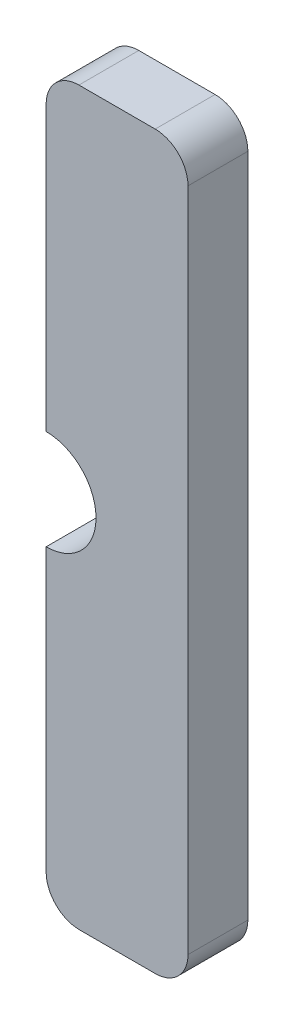
ISO-10303-21;
HEADER;
FILE_DESCRIPTION(('STEP AP214'),'2;1');
FILE_NAME('part.step','',(''),(''),'','','');
FILE_SCHEMA(('AUTOMOTIVE_DESIGN { 1 0 10303 214 1 1 1 1 }'));
ENDSEC;
DATA;
#1=APPLICATION_CONTEXT('core data for automotive mechanical design processes');
#2=APPLICATION_PROTOCOL_DEFINITION('international standard','automotive_design',2000,#1);
#3=PRODUCT_CONTEXT('',#1,'mechanical');
#4=PRODUCT('Part','Part','',(#3));
#5=PRODUCT_RELATED_PRODUCT_CATEGORY('part','',(#4));
#6=PRODUCT_DEFINITION_FORMATION('','',#4);
#7=PRODUCT_DEFINITION_CONTEXT('part definition',#1,'design');
#8=PRODUCT_DEFINITION('design','',#6,#7);
#9=PRODUCT_DEFINITION_SHAPE('','',#8);
#10=(LENGTH_UNIT() NAMED_UNIT(*) SI_UNIT(.MILLI.,.METRE.));
#11=(NAMED_UNIT(*) PLANE_ANGLE_UNIT() SI_UNIT($,.RADIAN.));
#12=(NAMED_UNIT(*) SI_UNIT($,.STERADIAN.) SOLID_ANGLE_UNIT());
#13=UNCERTAINTY_MEASURE_WITH_UNIT(LENGTH_MEASURE(1.E-05),#10,'distance_accuracy_value','');
#14=(GEOMETRIC_REPRESENTATION_CONTEXT(3) GLOBAL_UNCERTAINTY_ASSIGNED_CONTEXT((#13)) GLOBAL_UNIT_ASSIGNED_CONTEXT((#10,
#11,#12)) REPRESENTATION_CONTEXT('',''));
#15=CARTESIAN_POINT('',(0.,0.,0.));
#16=DIRECTION('',(0.,0.,1.));
#17=DIRECTION('',(1.,0.,0.));
#18=AXIS2_PLACEMENT_3D('',#15,#16,#17);
#19=CARTESIAN_POINT('',(32.3994125239925,26.550586330623,2.1));
#20=DIRECTION('',(0.,0.,-1.));
#21=DIRECTION('',(-1.,0.,0.));
#22=AXIS2_PLACEMENT_3D('',#19,#20,#21);
#23=CYLINDRICAL_SURFACE('',#22,1.15058686285202);
#24=CARTESIAN_POINT('',(32.3994125239925,26.550586330623,0.));
#25=DIRECTION('',(0.,0.,-1.));
#26=DIRECTION('',(-1.,0.,0.));
#27=AXIS2_PLACEMENT_3D('',#24,#25,#26);
#28=CIRCLE('',#27,1.15058686285202);
#29=CARTESIAN_POINT('',(33.5499992370605,26.5499992370606,0.));
#30=VERTEX_POINT('',#29);
#31=CARTESIAN_POINT('',(32.4000015258789,25.3999996185303,0.));
#32=VERTEX_POINT('',#31);
#33=EDGE_CURVE('E144',#30,#32,#28,.T.);
#34=ORIENTED_EDGE('',*,*,#33,.F.);
#35=DIRECTION('',(0.,0.,-1.));
#36=VECTOR('',#35,1.);
#37=CARTESIAN_POINT('',(33.5499992370605,26.5499992370606,2.1));
#38=LINE('',#37,#36);
#39=CARTESIAN_POINT('',(33.5499992370605,26.5499992370606,2.1));
#40=VERTEX_POINT('',#39);
#41=EDGE_CURVE('E11',#40,#30,#38,.T.);
#42=ORIENTED_EDGE('',*,*,#41,.F.);
#43=CARTESIAN_POINT('',(32.3994125239925,26.550586330623,2.1));
#44=DIRECTION('',(0.,0.,-1.));
#45=DIRECTION('',(-1.,0.,0.));
#46=AXIS2_PLACEMENT_3D('',#43,#44,#45);
#47=CIRCLE('',#46,1.15058686285202);
#48=CARTESIAN_POINT('',(32.4000015258789,25.3999996185303,2.1));
#49=VERTEX_POINT('',#48);
#50=EDGE_CURVE('E170',#40,#49,#47,.T.);
#51=ORIENTED_EDGE('',*,*,#50,.T.);
#52=DIRECTION('',(0.,0.,-1.));
#53=VECTOR('',#52,1.);
#54=CARTESIAN_POINT('',(32.4000015258789,25.3999996185303,2.1));
#55=LINE('',#54,#53);
#56=EDGE_CURVE('E38',#49,#32,#55,.T.);
#57=ORIENTED_EDGE('',*,*,#56,.T.);
#58=EDGE_LOOP('',(#34,#42,#51,#57));
#59=FACE_BOUND('',#58,.T.);
#60=ADVANCED_FACE('F35',(#59),#23,.T.);
#61=CARTESIAN_POINT('',(33.5499992370605,49.9000015258789,2.1));
#62=DIRECTION('',(1.,0.,0.));
#63=DIRECTION('',(0.,0.,-1.));
#64=AXIS2_PLACEMENT_3D('',#61,#62,#63);
#65=PLANE('',#64);
#66=DIRECTION('',(0.,-1.,0.));
#67=VECTOR('',#66,1.);
#68=CARTESIAN_POINT('',(33.5499992370605,49.9000015258789,0.));
#69=LINE('',#68,#67);
#70=CARTESIAN_POINT('',(33.5499992370605,49.9000015258789,0.));
#71=VERTEX_POINT('',#70);
#72=EDGE_CURVE('E168',#71,#30,#69,.T.);
#73=ORIENTED_EDGE('',*,*,#72,.F.);
#74=DIRECTION('',(0.,0.,-1.));
#75=VECTOR('',#74,1.);
#76=CARTESIAN_POINT('',(33.5499992370605,49.9000015258789,2.1));
#77=LINE('',#76,#75);
#78=CARTESIAN_POINT('',(33.5499992370605,49.9000015258789,2.1));
#79=VERTEX_POINT('',#78);
#80=EDGE_CURVE('E44',#79,#71,#77,.T.);
#81=ORIENTED_EDGE('',*,*,#80,.F.);
#82=DIRECTION('',(0.,-1.,0.));
#83=VECTOR('',#82,1.);
#84=CARTESIAN_POINT('',(33.5499992370605,49.9000015258789,2.1));
#85=LINE('',#84,#83);
#86=EDGE_CURVE('E134',#79,#40,#85,.T.);
#87=ORIENTED_EDGE('',*,*,#86,.T.);
#88=ORIENTED_EDGE('',*,*,#41,.T.);
#89=EDGE_LOOP('',(#73,#81,#87,#88));
#90=FACE_BOUND('',#89,.T.);
#91=ADVANCED_FACE('F186',(#90),#65,.T.);
#92=CARTESIAN_POINT('',(32.3994157833647,49.8994157833647,2.1));
#93=DIRECTION('',(0.,0.,-1.));
#94=DIRECTION('',(-1.,0.,0.));
#95=AXIS2_PLACEMENT_3D('',#92,#93,#94);
#96=CYLINDRICAL_SURFACE('',#95,1.15058360279163);
#97=CARTESIAN_POINT('',(32.3994157833647,49.8994157833647,0.));
#98=DIRECTION('',(0.,0.,-1.));
#99=DIRECTION('',(-1.,0.,0.));
#100=AXIS2_PLACEMENT_3D('',#97,#98,#99);
#101=CIRCLE('',#100,1.15058360279163);
#102=CARTESIAN_POINT('',(32.4000015258789,51.0499992370605,0.));
#103=VERTEX_POINT('',#102);
#104=EDGE_CURVE('E121',#103,#71,#101,.T.);
#105=ORIENTED_EDGE('',*,*,#104,.F.);
#106=DIRECTION('',(0.,0.,-1.));
#107=VECTOR('',#106,1.);
#108=CARTESIAN_POINT('',(32.4000015258789,51.0499992370605,2.1));
#109=LINE('',#108,#107);
#110=CARTESIAN_POINT('',(32.4000015258789,51.0499992370605,2.1));
#111=VERTEX_POINT('',#110);
#112=EDGE_CURVE('E116',#111,#103,#109,.T.);
#113=ORIENTED_EDGE('',*,*,#112,.F.);
#114=CARTESIAN_POINT('',(32.3994157833647,49.8994157833647,2.1));
#115=DIRECTION('',(0.,0.,-1.));
#116=DIRECTION('',(-1.,0.,0.));
#117=AXIS2_PLACEMENT_3D('',#114,#115,#116);
#118=CIRCLE('',#117,1.15058360279163);
#119=EDGE_CURVE('E119',#111,#79,#118,.T.);
#120=ORIENTED_EDGE('',*,*,#119,.T.);
#121=ORIENTED_EDGE('',*,*,#80,.T.);
#122=EDGE_LOOP('',(#105,#113,#120,#121));
#123=FACE_BOUND('',#122,.T.);
#124=ADVANCED_FACE('F118',(#123),#96,.T.);
#125=CARTESIAN_POINT('',(29.7250003814697,51.0499992370605,2.1));
#126=DIRECTION('',(0.,1.,0.));
#127=DIRECTION('',(0.,0.,1.));
#128=AXIS2_PLACEMENT_3D('',#125,#126,#127);
#129=PLANE('',#128);
#130=DIRECTION('',(1.,0.,0.));
#131=VECTOR('',#130,1.);
#132=CARTESIAN_POINT('',(29.7250003814697,51.0499992370605,0.));
#133=LINE('',#132,#131);
#134=CARTESIAN_POINT('',(29.7250003814697,51.0499992370605,0.));
#135=VERTEX_POINT('',#134);
#136=EDGE_CURVE('E165',#135,#103,#133,.T.);
#137=ORIENTED_EDGE('',*,*,#136,.F.);
#138=DIRECTION('',(0.,0.,-1.));
#139=VECTOR('',#138,1.);
#140=CARTESIAN_POINT('',(29.7250003814697,51.0499992370605,2.1));
#141=LINE('',#140,#139);
#142=CARTESIAN_POINT('',(29.7250003814697,51.0499992370605,2.1));
#143=VERTEX_POINT('',#142);
#144=EDGE_CURVE('E126',#143,#135,#141,.T.);
#145=ORIENTED_EDGE('',*,*,#144,.F.);
#146=DIRECTION('',(1.,0.,0.));
#147=VECTOR('',#146,1.);
#148=CARTESIAN_POINT('',(29.7250003814697,51.0499992370605,2.1));
#149=LINE('',#148,#147);
#150=EDGE_CURVE('E132',#143,#111,#149,.T.);
#151=ORIENTED_EDGE('',*,*,#150,.T.);
#152=ORIENTED_EDGE('',*,*,#112,.T.);
#153=EDGE_LOOP('',(#137,#145,#151,#152));
#154=FACE_BOUND('',#153,.T.);
#155=ADVANCED_FACE('F136',(#154),#129,.T.);
#156=CARTESIAN_POINT('',(29.7255874750322,49.8994125239925,2.1));
#157=DIRECTION('',(0.,0.,-1.));
#158=DIRECTION('',(-1.,0.,0.));
#159=AXIS2_PLACEMENT_3D('',#156,#157,#158);
#160=CYLINDRICAL_SURFACE('',#159,1.15058686285202);
#161=CARTESIAN_POINT('',(29.7255874750322,49.8994125239925,0.));
#162=DIRECTION('',(0.,0.,-1.));
#163=DIRECTION('',(-1.,0.,0.));
#164=AXIS2_PLACEMENT_3D('',#161,#162,#163);
#165=CIRCLE('',#164,1.15058686285202);
#166=CARTESIAN_POINT('',(28.5750358508394,49.9084174690227,0.));
#167=VERTEX_POINT('',#166);
#168=EDGE_CURVE('E162',#167,#135,#165,.T.);
#169=ORIENTED_EDGE('',*,*,#168,.F.);
#170=DIRECTION('',(0.,0.,-1.));
#171=VECTOR('',#170,1.);
#172=CARTESIAN_POINT('',(28.5750358508394,49.9084174690227,2.1));
#173=LINE('',#172,#171);
#174=CARTESIAN_POINT('',(28.5750358508394,49.9084174690227,2.1));
#175=VERTEX_POINT('',#174);
#176=EDGE_CURVE('E174',#175,#167,#173,.T.);
#177=ORIENTED_EDGE('',*,*,#176,.F.);
#178=CARTESIAN_POINT('',(29.7255874750322,49.8994125239925,2.1));
#179=DIRECTION('',(0.,0.,-1.));
#180=DIRECTION('',(-1.,0.,0.));
#181=AXIS2_PLACEMENT_3D('',#178,#179,#180);
#182=CIRCLE('',#181,1.15058686285202);
#183=EDGE_CURVE('E137',#175,#143,#182,.T.);
#184=ORIENTED_EDGE('',*,*,#183,.T.);
#185=ORIENTED_EDGE('',*,*,#144,.T.);
#186=EDGE_LOOP('',(#169,#177,#184,#185));
#187=FACE_BOUND('',#186,.T.);
#188=ADVANCED_FACE('F199',(#187),#160,.T.);
#189=CARTESIAN_POINT('',(28.5750358508394,39.9501794441424,2.1));
#190=DIRECTION('',(-1.,0.,0.));
#191=DIRECTION('',(0.,-1.,0.));
#192=AXIS2_PLACEMENT_3D('',#189,#190,#191);
#193=PLANE('',#192);
#194=DIRECTION('',(0.,1.,0.));
#195=VECTOR('',#194,1.);
#196=CARTESIAN_POINT('',(28.5750358508394,39.9501794441424,0.));
#197=LINE('',#196,#195);
#198=CARTESIAN_POINT('',(28.5750358508394,39.9501794441424,0.));
#199=VERTEX_POINT('',#198);
#200=EDGE_CURVE('E159',#199,#167,#197,.T.);
#201=ORIENTED_EDGE('',*,*,#200,.F.);
#202=DIRECTION('',(0.,0.,-1.));
#203=VECTOR('',#202,1.);
#204=CARTESIAN_POINT('',(28.5750358508394,39.9501794441424,2.1));
#205=LINE('',#204,#203);
#206=CARTESIAN_POINT('',(28.5750358508394,39.9501794441424,2.1));
#207=VERTEX_POINT('',#206);
#208=EDGE_CURVE('E176',#207,#199,#205,.T.);
#209=ORIENTED_EDGE('',*,*,#208,.F.);
#210=DIRECTION('',(0.,1.,0.));
#211=VECTOR('',#210,1.);
#212=CARTESIAN_POINT('',(28.5750358508394,39.9501794441424,2.1));
#213=LINE('',#212,#211);
#214=EDGE_CURVE('E139',#207,#175,#213,.T.);
#215=ORIENTED_EDGE('',*,*,#214,.T.);
#216=ORIENTED_EDGE('',*,*,#176,.T.);
#217=EDGE_LOOP('',(#201,#209,#215,#216));
#218=FACE_BOUND('',#217,.T.);
#219=ADVANCED_FACE('F202',(#218),#193,.T.);
#220=CARTESIAN_POINT('',(28.5750358508394,38.2001849141649,2.1));
#221=DIRECTION('',(0.,0.,-1.));
#222=DIRECTION('',(-1.,0.,0.));
#223=AXIS2_PLACEMENT_3D('',#220,#221,#222);
#224=CYLINDRICAL_SURFACE('',#223,1.74999452997755);
#225=CARTESIAN_POINT('',(28.5750358508394,38.2001849141649,0.));
#226=DIRECTION('',(0.,0.,1.));
#227=DIRECTION('',(-1.,0.,0.));
#228=AXIS2_PLACEMENT_3D('',#225,#226,#227);
#229=CIRCLE('',#228,1.74999452997755);
#230=CARTESIAN_POINT('',(28.5750358508394,36.4501903841873,0.));
#231=VERTEX_POINT('',#230);
#232=EDGE_CURVE('E156',#231,#199,#229,.T.);
#233=ORIENTED_EDGE('',*,*,#232,.F.);
#234=DIRECTION('',(0.,0.,-1.));
#235=VECTOR('',#234,1.);
#236=CARTESIAN_POINT('',(28.5750358508394,36.4501903841873,2.1));
#237=LINE('',#236,#235);
#238=CARTESIAN_POINT('',(28.5750358508394,36.4501903841873,2.1));
#239=VERTEX_POINT('',#238);
#240=EDGE_CURVE('E178',#239,#231,#237,.T.);
#241=ORIENTED_EDGE('',*,*,#240,.F.);
#242=CARTESIAN_POINT('',(28.5750358508394,38.2001849141649,2.1));
#243=DIRECTION('',(0.,0.,1.));
#244=DIRECTION('',(-1.,0.,0.));
#245=AXIS2_PLACEMENT_3D('',#242,#243,#244);
#246=CIRCLE('',#245,1.74999452997755);
#247=EDGE_CURVE('E301',#239,#207,#246,.T.);
#248=ORIENTED_EDGE('',*,*,#247,.T.);
#249=ORIENTED_EDGE('',*,*,#208,.T.);
#250=EDGE_LOOP('',(#233,#241,#248,#249));
#251=FACE_BOUND('',#250,.T.);
#252=ADVANCED_FACE('F206',(#251),#224,.F.);
#253=CARTESIAN_POINT('',(28.5750358508394,26.5835818213462,2.1));
#254=DIRECTION('',(-1.,0.,0.));
#255=DIRECTION('',(0.,-1.,0.));
#256=AXIS2_PLACEMENT_3D('',#253,#254,#255);
#257=PLANE('',#256);
#258=DIRECTION('',(0.,1.,0.));
#259=VECTOR('',#258,1.);
#260=CARTESIAN_POINT('',(28.5750358508394,26.5835818213462,0.));
#261=LINE('',#260,#259);
#262=CARTESIAN_POINT('',(28.5750358508394,26.5835818213462,0.));
#263=VERTEX_POINT('',#262);
#264=EDGE_CURVE('E153',#263,#231,#261,.T.);
#265=ORIENTED_EDGE('',*,*,#264,.F.);
#266=DIRECTION('',(0.,0.,-1.));
#267=VECTOR('',#266,1.);
#268=CARTESIAN_POINT('',(28.5750358508394,26.5835818213462,2.1));
#269=LINE('',#268,#267);
#270=CARTESIAN_POINT('',(28.5750358508394,26.5835818213462,2.1));
#271=VERTEX_POINT('',#270);
#272=EDGE_CURVE('E180',#271,#263,#269,.T.);
#273=ORIENTED_EDGE('',*,*,#272,.F.);
#274=DIRECTION('',(0.,1.,0.));
#275=VECTOR('',#274,1.);
#276=CARTESIAN_POINT('',(28.5750358508394,26.5835818213462,2.1));
#277=LINE('',#276,#275);
#278=EDGE_CURVE('E297',#271,#239,#277,.T.);
#279=ORIENTED_EDGE('',*,*,#278,.T.);
#280=ORIENTED_EDGE('',*,*,#240,.T.);
#281=EDGE_LOOP('',(#265,#273,#279,#280));
#282=FACE_BOUND('',#281,.T.);
#283=ADVANCED_FACE('F210',(#282),#257,.T.);
#284=CARTESIAN_POINT('',(29.749490027406,26.5744888838262,2.1));
#285=DIRECTION('',(0.,0.,-1.));
#286=DIRECTION('',(-1.,0.,0.));
#287=AXIS2_PLACEMENT_3D('',#284,#285,#286);
#288=CYLINDRICAL_SURFACE('',#287,1.17448937601304);
#289=CARTESIAN_POINT('',(29.749490027406,26.5744888838262,0.));
#290=DIRECTION('',(0.,0.,-1.));
#291=DIRECTION('',(-1.,0.,0.));
#292=AXIS2_PLACEMENT_3D('',#289,#290,#291);
#293=CIRCLE('',#292,1.17448937601304);
#294=CARTESIAN_POINT('',(29.75,25.3999996185303,0.));
#295=VERTEX_POINT('',#294);
#296=EDGE_CURVE('E150',#295,#263,#293,.T.);
#297=ORIENTED_EDGE('',*,*,#296,.F.);
#298=DIRECTION('',(0.,0.,-1.));
#299=VECTOR('',#298,1.);
#300=CARTESIAN_POINT('',(29.75,25.3999996185303,2.1));
#301=LINE('',#300,#299);
#302=CARTESIAN_POINT('',(29.75,25.3999996185303,2.1));
#303=VERTEX_POINT('',#302);
#304=EDGE_CURVE('E181',#303,#295,#301,.T.);
#305=ORIENTED_EDGE('',*,*,#304,.F.);
#306=CARTESIAN_POINT('',(29.749490027406,26.5744888838262,2.1));
#307=DIRECTION('',(0.,0.,-1.));
#308=DIRECTION('',(-1.,0.,0.));
#309=AXIS2_PLACEMENT_3D('',#306,#307,#308);
#310=CIRCLE('',#309,1.17448937601304);
#311=EDGE_CURVE('E308',#303,#271,#310,.T.);
#312=ORIENTED_EDGE('',*,*,#311,.T.);
#313=ORIENTED_EDGE('',*,*,#272,.T.);
#314=EDGE_LOOP('',(#297,#305,#312,#313));
#315=FACE_BOUND('',#314,.T.);
#316=ADVANCED_FACE('F214',(#315),#288,.T.);
#317=CARTESIAN_POINT('',(32.4000015258789,25.3999996185303,2.1));
#318=DIRECTION('',(0.,-1.,0.));
#319=DIRECTION('',(0.,0.,-1.));
#320=AXIS2_PLACEMENT_3D('',#317,#318,#319);
#321=PLANE('',#320);
#322=DIRECTION('',(-1.,0.,0.));
#323=VECTOR('',#322,1.);
#324=CARTESIAN_POINT('',(32.4000015258789,25.3999996185303,0.));
#325=LINE('',#324,#323);
#326=EDGE_CURVE('E147',#32,#295,#325,.T.);
#327=ORIENTED_EDGE('',*,*,#326,.F.);
#328=ORIENTED_EDGE('',*,*,#56,.F.);
#329=DIRECTION('',(-1.,0.,0.));
#330=VECTOR('',#329,1.);
#331=CARTESIAN_POINT('',(32.4000015258789,25.3999996185303,2.1));
#332=LINE('',#331,#330);
#333=EDGE_CURVE('E310',#49,#303,#332,.T.);
#334=ORIENTED_EDGE('',*,*,#333,.T.);
#335=ORIENTED_EDGE('',*,*,#304,.T.);
#336=EDGE_LOOP('',(#327,#328,#334,#335));
#337=FACE_BOUND('',#336,.T.);
#338=ADVANCED_FACE('F183',(#337),#321,.T.);
#339=CARTESIAN_POINT('',(32.3994125239925,26.550586330623,2.1));
#340=DIRECTION('',(0.,0.,-1.));
#341=DIRECTION('',(-1.,0.,0.));
#342=AXIS2_PLACEMENT_3D('',#339,#340,#341);
#343=PLANE('',#342);
#344=ORIENTED_EDGE('',*,*,#50,.F.);
#345=ORIENTED_EDGE('',*,*,#86,.F.);
#346=ORIENTED_EDGE('',*,*,#119,.F.);
#347=ORIENTED_EDGE('',*,*,#150,.F.);
#348=ORIENTED_EDGE('',*,*,#183,.F.);
#349=ORIENTED_EDGE('',*,*,#214,.F.);
#350=ORIENTED_EDGE('',*,*,#247,.F.);
#351=ORIENTED_EDGE('',*,*,#278,.F.);
#352=ORIENTED_EDGE('',*,*,#311,.F.);
#353=ORIENTED_EDGE('',*,*,#333,.F.);
#354=EDGE_LOOP('',(#344,#345,#346,#347,#348,#349,#350,#351,#352,#353));
#355=FACE_BOUND('',#354,.T.);
#356=ADVANCED_FACE('F130',(#355),#343,.F.);
#357=CARTESIAN_POINT('',(32.3994125239925,26.550586330623,0.));
#358=DIRECTION('',(0.,0.,-1.));
#359=DIRECTION('',(-1.,0.,0.));
#360=AXIS2_PLACEMENT_3D('',#357,#358,#359);
#361=PLANE('',#360);
#362=ORIENTED_EDGE('',*,*,#33,.T.);
#363=ORIENTED_EDGE('',*,*,#326,.T.);
#364=ORIENTED_EDGE('',*,*,#296,.T.);
#365=ORIENTED_EDGE('',*,*,#264,.T.);
#366=ORIENTED_EDGE('',*,*,#232,.T.);
#367=ORIENTED_EDGE('',*,*,#200,.T.);
#368=ORIENTED_EDGE('',*,*,#168,.T.);
#369=ORIENTED_EDGE('',*,*,#136,.T.);
#370=ORIENTED_EDGE('',*,*,#104,.T.);
#371=ORIENTED_EDGE('',*,*,#72,.T.);
#372=EDGE_LOOP('',(#362,#363,#364,#365,#366,#367,#368,#369,#370,#371));
#373=FACE_BOUND('',#372,.T.);
#374=ADVANCED_FACE('F185',(#373),#361,.T.);
#375=CLOSED_SHELL('',(#60,#91,#124,#155,#188,#219,#252,#283,#316,#338,#356,#374));
#376=MANIFOLD_SOLID_BREP('B2',#375);
#377=ADVANCED_BREP_SHAPE_REPRESENTATION('',(#18,#376),#14);
#378=SHAPE_DEFINITION_REPRESENTATION(#9,#377);
ENDSEC;
END-ISO-10303-21;
